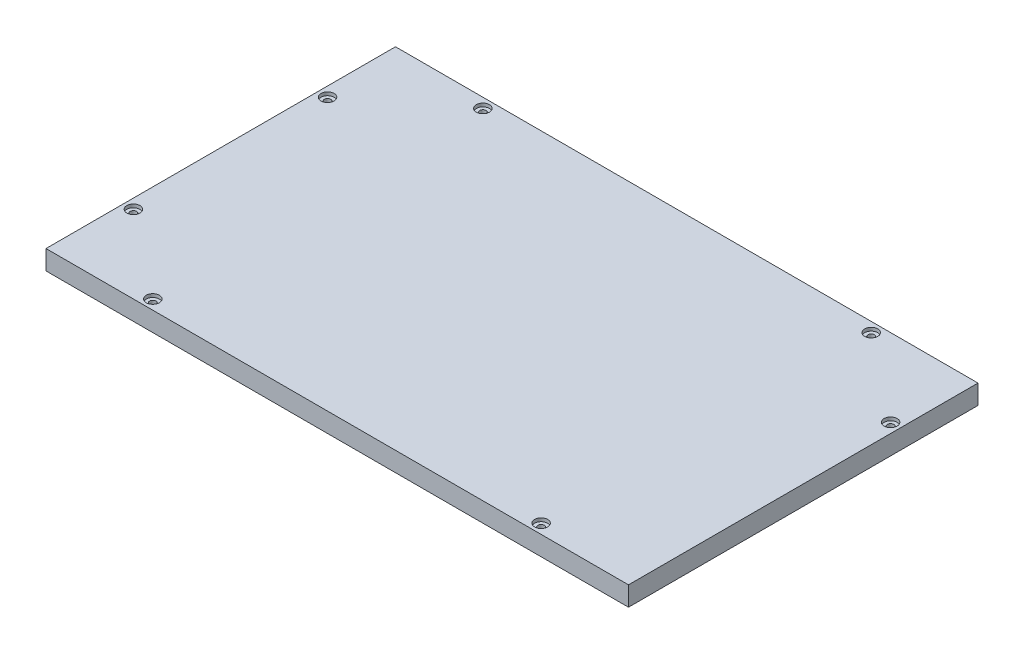
ISO-10303-21;
HEADER;
FILE_DESCRIPTION(('STEP AP214'),'2;1');
FILE_NAME('part.step','',(''),(''),'','','');
FILE_SCHEMA(('AUTOMOTIVE_DESIGN { 1 0 10303 214 1 1 1 1 }'));
ENDSEC;
DATA;
#1=APPLICATION_CONTEXT('core data for automotive mechanical design processes');
#2=APPLICATION_PROTOCOL_DEFINITION('international standard','automotive_design',2000,#1);
#3=PRODUCT_CONTEXT('',#1,'mechanical');
#4=PRODUCT('Part','Part','',(#3));
#5=PRODUCT_RELATED_PRODUCT_CATEGORY('part','',(#4));
#6=PRODUCT_DEFINITION_FORMATION('','',#4);
#7=PRODUCT_DEFINITION_CONTEXT('part definition',#1,'design');
#8=PRODUCT_DEFINITION('design','',#6,#7);
#9=PRODUCT_DEFINITION_SHAPE('','',#8);
#10=(LENGTH_UNIT() NAMED_UNIT(*) SI_UNIT(.MILLI.,.METRE.));
#11=(NAMED_UNIT(*) PLANE_ANGLE_UNIT() SI_UNIT($,.RADIAN.));
#12=(NAMED_UNIT(*) SI_UNIT($,.STERADIAN.) SOLID_ANGLE_UNIT());
#13=UNCERTAINTY_MEASURE_WITH_UNIT(LENGTH_MEASURE(1.E-05),#10,'distance_accuracy_value','');
#14=(GEOMETRIC_REPRESENTATION_CONTEXT(3) GLOBAL_UNCERTAINTY_ASSIGNED_CONTEXT((#13)) GLOBAL_UNIT_ASSIGNED_CONTEXT((#10,
#11,#12)) REPRESENTATION_CONTEXT('',''));
#15=CARTESIAN_POINT('',(0.,0.,0.));
#16=DIRECTION('',(0.,0.,1.));
#17=DIRECTION('',(1.,0.,0.));
#18=AXIS2_PLACEMENT_3D('',#15,#16,#17);
#19=CARTESIAN_POINT('',(-128.360655737705,10.,-77.7049180327869));
#20=DIRECTION('',(1.,0.,0.));
#21=DIRECTION('',(0.,0.,-1.));
#22=AXIS2_PLACEMENT_3D('',#19,#20,#21);
#23=PLANE('',#22);
#24=DIRECTION('',(0.,0.,1.));
#25=VECTOR('',#24,1.);
#26=CARTESIAN_POINT('',(-128.360655737705,0.,-77.7049180327869));
#27=LINE('',#26,#25);
#28=CARTESIAN_POINT('',(-128.360655737705,0.,-77.7049180327869));
#29=VERTEX_POINT('',#28);
#30=CARTESIAN_POINT('',(-128.360655737705,0.,102.295081967213));
#31=VERTEX_POINT('',#30);
#32=EDGE_CURVE('E107',#29,#31,#27,.T.);
#33=ORIENTED_EDGE('',*,*,#32,.T.);
#34=DIRECTION('',(0.,-1.,0.));
#35=VECTOR('',#34,1.);
#36=CARTESIAN_POINT('',(-128.360655737705,10.,102.295081967213));
#37=LINE('',#36,#35);
#38=CARTESIAN_POINT('',(-128.360655737705,10.,102.295081967213));
#39=VERTEX_POINT('',#38);
#40=EDGE_CURVE('E11',#39,#31,#37,.T.);
#41=ORIENTED_EDGE('',*,*,#40,.F.);
#42=DIRECTION('',(0.,0.,1.));
#43=VECTOR('',#42,1.);
#44=CARTESIAN_POINT('',(-128.360655737705,10.,-77.7049180327869));
#45=LINE('',#44,#43);
#46=CARTESIAN_POINT('',(-128.360655737705,10.,-77.7049180327869));
#47=VERTEX_POINT('',#46);
#48=EDGE_CURVE('E91',#47,#39,#45,.T.);
#49=ORIENTED_EDGE('',*,*,#48,.F.);
#50=DIRECTION('',(0.,-1.,0.));
#51=VECTOR('',#50,1.);
#52=CARTESIAN_POINT('',(-128.360655737705,10.,-77.7049180327869));
#53=LINE('',#52,#51);
#54=EDGE_CURVE('E103',#47,#29,#53,.T.);
#55=ORIENTED_EDGE('',*,*,#54,.T.);
#56=EDGE_LOOP('',(#33,#41,#49,#55));
#57=FACE_BOUND('',#56,.T.);
#58=ADVANCED_FACE('F39',(#57),#23,.F.);
#59=CARTESIAN_POINT('',(-128.360655737705,10.,102.295081967213));
#60=DIRECTION('',(0.,0.,-1.));
#61=DIRECTION('',(-1.,0.,0.));
#62=AXIS2_PLACEMENT_3D('',#59,#60,#61);
#63=PLANE('',#62);
#64=DIRECTION('',(1.,0.,0.));
#65=VECTOR('',#64,1.);
#66=CARTESIAN_POINT('',(-128.360655737705,0.,102.295081967213));
#67=LINE('',#66,#65);
#68=CARTESIAN_POINT('',(171.639344262295,0.,102.295081967213));
#69=VERTEX_POINT('',#68);
#70=EDGE_CURVE('E96',#31,#69,#67,.T.);
#71=ORIENTED_EDGE('',*,*,#70,.T.);
#72=DIRECTION('',(0.,-1.,0.));
#73=VECTOR('',#72,1.);
#74=CARTESIAN_POINT('',(171.639344262295,10.,102.295081967213));
#75=LINE('',#74,#73);
#76=CARTESIAN_POINT('',(171.639344262295,10.,102.295081967213));
#77=VERTEX_POINT('',#76);
#78=EDGE_CURVE('E48',#77,#69,#75,.T.);
#79=ORIENTED_EDGE('',*,*,#78,.F.);
#80=DIRECTION('',(1.,0.,0.));
#81=VECTOR('',#80,1.);
#82=CARTESIAN_POINT('',(-128.360655737705,10.,102.295081967213));
#83=LINE('',#82,#81);
#84=EDGE_CURVE('E86',#39,#77,#83,.T.);
#85=ORIENTED_EDGE('',*,*,#84,.F.);
#86=ORIENTED_EDGE('',*,*,#40,.T.);
#87=EDGE_LOOP('',(#71,#79,#85,#86));
#88=FACE_BOUND('',#87,.T.);
#89=ADVANCED_FACE('F95',(#88),#63,.F.);
#90=CARTESIAN_POINT('',(171.639344262295,10.,-77.7049180327869));
#91=DIRECTION('',(-1.,0.,0.));
#92=DIRECTION('',(0.,0.,1.));
#93=AXIS2_PLACEMENT_3D('',#90,#91,#92);
#94=PLANE('',#93);
#95=DIRECTION('',(0.,0.,-1.));
#96=VECTOR('',#95,1.);
#97=CARTESIAN_POINT('',(171.639344262295,0.,-77.7049180327869));
#98=LINE('',#97,#96);
#99=CARTESIAN_POINT('',(171.639344262295,0.,-77.7049180327869));
#100=VERTEX_POINT('',#99);
#101=EDGE_CURVE('E73',#69,#100,#98,.T.);
#102=ORIENTED_EDGE('',*,*,#101,.T.);
#103=DIRECTION('',(0.,-1.,0.));
#104=VECTOR('',#103,1.);
#105=CARTESIAN_POINT('',(171.639344262295,10.,-77.7049180327869));
#106=LINE('',#105,#104);
#107=CARTESIAN_POINT('',(171.639344262295,10.,-77.7049180327869));
#108=VERTEX_POINT('',#107);
#109=EDGE_CURVE('E98',#108,#100,#106,.T.);
#110=ORIENTED_EDGE('',*,*,#109,.F.);
#111=DIRECTION('',(0.,0.,-1.));
#112=VECTOR('',#111,1.);
#113=CARTESIAN_POINT('',(171.639344262295,10.,-77.7049180327869));
#114=LINE('',#113,#112);
#115=EDGE_CURVE('E89',#77,#108,#114,.T.);
#116=ORIENTED_EDGE('',*,*,#115,.F.);
#117=ORIENTED_EDGE('',*,*,#78,.T.);
#118=EDGE_LOOP('',(#102,#110,#116,#117));
#119=FACE_BOUND('',#118,.T.);
#120=ADVANCED_FACE('F99',(#119),#94,.F.);
#121=CARTESIAN_POINT('',(-128.360655737705,10.,-77.7049180327869));
#122=DIRECTION('',(0.,0.,1.));
#123=DIRECTION('',(1.,0.,0.));
#124=AXIS2_PLACEMENT_3D('',#121,#122,#123);
#125=PLANE('',#124);
#126=DIRECTION('',(-1.,0.,0.));
#127=VECTOR('',#126,1.);
#128=CARTESIAN_POINT('',(-128.360655737705,0.,-77.7049180327869));
#129=LINE('',#128,#127);
#130=EDGE_CURVE('E79',#100,#29,#129,.T.);
#131=ORIENTED_EDGE('',*,*,#130,.T.);
#132=ORIENTED_EDGE('',*,*,#54,.F.);
#133=DIRECTION('',(-1.,0.,0.));
#134=VECTOR('',#133,1.);
#135=CARTESIAN_POINT('',(-128.360655737705,10.,-77.7049180327869));
#136=LINE('',#135,#134);
#137=EDGE_CURVE('E56',#108,#47,#136,.T.);
#138=ORIENTED_EDGE('',*,*,#137,.F.);
#139=ORIENTED_EDGE('',*,*,#109,.T.);
#140=EDGE_LOOP('',(#131,#132,#138,#139));
#141=FACE_BOUND('',#140,.T.);
#142=ADVANCED_FACE('F121',(#141),#125,.F.);
#143=CARTESIAN_POINT('',(0.,10.,0.));
#144=DIRECTION('',(0.,1.,0.));
#145=DIRECTION('',(0.,0.,1.));
#146=AXIS2_PLACEMENT_3D('',#143,#144,#145);
#147=PLANE('',#146);
#148=CARTESIAN_POINT('',(-123.360655737705,10.,-37.7049180327869));
#149=DIRECTION('',(0.,1.,0.));
#150=DIRECTION('',(0.,0.,1.));
#151=AXIS2_PLACEMENT_3D('',#148,#149,#150);
#152=CIRCLE('',#151,3.37311999999999);
#153=CARTESIAN_POINT('',(-123.360655737705,10.,-34.3317980327869));
#154=VERTEX_POINT('',#153);
#155=EDGE_CURVE('E235',#154,#154,#152,.T.);
#156=ORIENTED_EDGE('',*,*,#155,.F.);
#157=EDGE_LOOP('',(#156));
#158=FACE_BOUND('',#157,.T.);
#159=CARTESIAN_POINT('',(-123.360655737705,10.,62.2950819672131));
#160=DIRECTION('',(0.,1.,0.));
#161=DIRECTION('',(0.,0.,1.));
#162=AXIS2_PLACEMENT_3D('',#159,#160,#161);
#163=CIRCLE('',#162,3.37311999999999);
#164=CARTESIAN_POINT('',(-123.360655737705,10.,65.6682019672131));
#165=VERTEX_POINT('',#164);
#166=EDGE_CURVE('E219',#165,#165,#163,.T.);
#167=ORIENTED_EDGE('',*,*,#166,.F.);
#168=EDGE_LOOP('',(#167));
#169=FACE_BOUND('',#168,.T.);
#170=CARTESIAN_POINT('',(-78.360655737705,10.,97.2950819672131));
#171=DIRECTION('',(0.,1.,0.));
#172=DIRECTION('',(0.,0.,1.));
#173=AXIS2_PLACEMENT_3D('',#170,#171,#172);
#174=CIRCLE('',#173,3.37311999999999);
#175=CARTESIAN_POINT('',(-78.360655737705,10.,100.668201967213));
#176=VERTEX_POINT('',#175);
#177=EDGE_CURVE('E203',#176,#176,#174,.T.);
#178=ORIENTED_EDGE('',*,*,#177,.F.);
#179=EDGE_LOOP('',(#178));
#180=FACE_BOUND('',#179,.T.);
#181=CARTESIAN_POINT('',(121.639344262295,10.,97.2950819672131));
#182=DIRECTION('',(0.,1.,0.));
#183=DIRECTION('',(0.,0.,1.));
#184=AXIS2_PLACEMENT_3D('',#181,#182,#183);
#185=CIRCLE('',#184,3.37312000000001);
#186=CARTESIAN_POINT('',(121.639344262295,10.,100.668201967213));
#187=VERTEX_POINT('',#186);
#188=EDGE_CURVE('E187',#187,#187,#185,.T.);
#189=ORIENTED_EDGE('',*,*,#188,.F.);
#190=EDGE_LOOP('',(#189));
#191=FACE_BOUND('',#190,.T.);
#192=CARTESIAN_POINT('',(121.639344262295,10.,-72.7049180327869));
#193=DIRECTION('',(0.,1.,0.));
#194=DIRECTION('',(0.,0.,1.));
#195=AXIS2_PLACEMENT_3D('',#192,#193,#194);
#196=CIRCLE('',#195,3.37312000000001);
#197=CARTESIAN_POINT('',(121.639344262295,10.,-69.3317980327869));
#198=VERTEX_POINT('',#197);
#199=EDGE_CURVE('E171',#198,#198,#196,.T.);
#200=ORIENTED_EDGE('',*,*,#199,.F.);
#201=EDGE_LOOP('',(#200));
#202=FACE_BOUND('',#201,.T.);
#203=CARTESIAN_POINT('',(166.639344262295,10.,-37.7049180327869));
#204=DIRECTION('',(0.,1.,0.));
#205=DIRECTION('',(0.,0.,1.));
#206=AXIS2_PLACEMENT_3D('',#203,#204,#205);
#207=CIRCLE('',#206,3.37312000000001);
#208=CARTESIAN_POINT('',(166.639344262295,10.,-34.3317980327869));
#209=VERTEX_POINT('',#208);
#210=EDGE_CURVE('E155',#209,#209,#207,.T.);
#211=ORIENTED_EDGE('',*,*,#210,.F.);
#212=EDGE_LOOP('',(#211));
#213=FACE_BOUND('',#212,.T.);
#214=CARTESIAN_POINT('',(-78.360655737705,10.,-72.7049180327869));
#215=DIRECTION('',(0.,1.,0.));
#216=DIRECTION('',(0.,0.,1.));
#217=AXIS2_PLACEMENT_3D('',#214,#215,#216);
#218=CIRCLE('',#217,3.37311999999999);
#219=CARTESIAN_POINT('',(-78.360655737705,10.,-69.3317980327869));
#220=VERTEX_POINT('',#219);
#221=EDGE_CURVE('E139',#220,#220,#218,.T.);
#222=ORIENTED_EDGE('',*,*,#221,.F.);
#223=EDGE_LOOP('',(#222));
#224=FACE_BOUND('',#223,.T.);
#225=ORIENTED_EDGE('',*,*,#48,.T.);
#226=ORIENTED_EDGE('',*,*,#84,.T.);
#227=ORIENTED_EDGE('',*,*,#115,.T.);
#228=ORIENTED_EDGE('',*,*,#137,.T.);
#229=EDGE_LOOP('',(#225,#226,#227,#228));
#230=FACE_BOUND('',#229,.T.);
#231=ADVANCED_FACE('F87',(#158,#169,#180,#191,#202,#213,#224,#230),#147,.T.);
#232=CARTESIAN_POINT('',(0.,0.,0.));
#233=DIRECTION('',(0.,1.,0.));
#234=DIRECTION('',(0.,0.,1.));
#235=AXIS2_PLACEMENT_3D('',#232,#233,#234);
#236=PLANE('',#235);
#237=CARTESIAN_POINT('',(-123.360655737705,0.,-37.7049180327869));
#238=DIRECTION('',(0.,1.,0.));
#239=DIRECTION('',(0.,0.,1.));
#240=AXIS2_PLACEMENT_3D('',#237,#238,#239);
#241=CIRCLE('',#240,1.63194999999999);
#242=CARTESIAN_POINT('',(-123.360655737705,0.,-36.0729680327869));
#243=VERTEX_POINT('',#242);
#244=EDGE_CURVE('E223',#243,#243,#241,.T.);
#245=ORIENTED_EDGE('',*,*,#244,.T.);
#246=EDGE_LOOP('',(#245));
#247=FACE_BOUND('',#246,.T.);
#248=CARTESIAN_POINT('',(-123.360655737705,0.,62.2950819672131));
#249=DIRECTION('',(0.,1.,0.));
#250=DIRECTION('',(0.,0.,1.));
#251=AXIS2_PLACEMENT_3D('',#248,#249,#250);
#252=CIRCLE('',#251,1.63194999999999);
#253=CARTESIAN_POINT('',(-123.360655737705,0.,63.9270319672131));
#254=VERTEX_POINT('',#253);
#255=EDGE_CURVE('E207',#254,#254,#252,.T.);
#256=ORIENTED_EDGE('',*,*,#255,.T.);
#257=EDGE_LOOP('',(#256));
#258=FACE_BOUND('',#257,.T.);
#259=CARTESIAN_POINT('',(-78.360655737705,0.,97.2950819672131));
#260=DIRECTION('',(0.,1.,0.));
#261=DIRECTION('',(0.,0.,1.));
#262=AXIS2_PLACEMENT_3D('',#259,#260,#261);
#263=CIRCLE('',#262,1.63194999999999);
#264=CARTESIAN_POINT('',(-78.360655737705,0.,98.9270319672131));
#265=VERTEX_POINT('',#264);
#266=EDGE_CURVE('E191',#265,#265,#263,.T.);
#267=ORIENTED_EDGE('',*,*,#266,.T.);
#268=EDGE_LOOP('',(#267));
#269=FACE_BOUND('',#268,.T.);
#270=CARTESIAN_POINT('',(121.639344262295,0.,97.2950819672131));
#271=DIRECTION('',(0.,1.,0.));
#272=DIRECTION('',(0.,0.,1.));
#273=AXIS2_PLACEMENT_3D('',#270,#271,#272);
#274=CIRCLE('',#273,1.63194999999999);
#275=CARTESIAN_POINT('',(121.639344262295,0.,98.9270319672131));
#276=VERTEX_POINT('',#275);
#277=EDGE_CURVE('E175',#276,#276,#274,.T.);
#278=ORIENTED_EDGE('',*,*,#277,.T.);
#279=EDGE_LOOP('',(#278));
#280=FACE_BOUND('',#279,.T.);
#281=CARTESIAN_POINT('',(121.639344262295,0.,-72.7049180327869));
#282=DIRECTION('',(0.,1.,0.));
#283=DIRECTION('',(0.,0.,1.));
#284=AXIS2_PLACEMENT_3D('',#281,#282,#283);
#285=CIRCLE('',#284,1.63194999999999);
#286=CARTESIAN_POINT('',(121.639344262295,0.,-71.0729680327869));
#287=VERTEX_POINT('',#286);
#288=EDGE_CURVE('E159',#287,#287,#285,.T.);
#289=ORIENTED_EDGE('',*,*,#288,.T.);
#290=EDGE_LOOP('',(#289));
#291=FACE_BOUND('',#290,.T.);
#292=CARTESIAN_POINT('',(166.639344262295,0.,-37.7049180327869));
#293=DIRECTION('',(0.,1.,0.));
#294=DIRECTION('',(0.,0.,1.));
#295=AXIS2_PLACEMENT_3D('',#292,#293,#294);
#296=CIRCLE('',#295,1.63194999999999);
#297=CARTESIAN_POINT('',(166.639344262295,0.,-36.0729680327869));
#298=VERTEX_POINT('',#297);
#299=EDGE_CURVE('E143',#298,#298,#296,.T.);
#300=ORIENTED_EDGE('',*,*,#299,.T.);
#301=EDGE_LOOP('',(#300));
#302=FACE_BOUND('',#301,.T.);
#303=CARTESIAN_POINT('',(-78.360655737705,0.,-72.7049180327869));
#304=DIRECTION('',(0.,1.,0.));
#305=DIRECTION('',(0.,0.,1.));
#306=AXIS2_PLACEMENT_3D('',#303,#304,#305);
#307=CIRCLE('',#306,1.63194999999999);
#308=CARTESIAN_POINT('',(-78.360655737705,0.,-71.0729680327869));
#309=VERTEX_POINT('',#308);
#310=EDGE_CURVE('E111',#309,#309,#307,.T.);
#311=ORIENTED_EDGE('',*,*,#310,.T.);
#312=EDGE_LOOP('',(#311));
#313=FACE_BOUND('',#312,.T.);
#314=ORIENTED_EDGE('',*,*,#32,.F.);
#315=ORIENTED_EDGE('',*,*,#130,.F.);
#316=ORIENTED_EDGE('',*,*,#101,.F.);
#317=ORIENTED_EDGE('',*,*,#70,.F.);
#318=EDGE_LOOP('',(#314,#315,#316,#317));
#319=FACE_BOUND('',#318,.T.);
#320=ADVANCED_FACE('F124',(#247,#258,#269,#280,#291,#302,#313,#319),#236,.F.);
#321=CARTESIAN_POINT('',(-78.360655737705,10.,-72.7049180327869));
#322=DIRECTION('',(0.,1.,0.));
#323=DIRECTION('',(0.,0.,1.));
#324=AXIS2_PLACEMENT_3D('',#321,#322,#323);
#325=CYLINDRICAL_SURFACE('',#324,1.63194999999999);
#326=ORIENTED_EDGE('',*,*,#310,.F.);
#327=EDGE_LOOP('',(#326));
#328=FACE_BOUND('',#327,.T.);
#329=CARTESIAN_POINT('',(-78.360655737705,8.2728,-72.7049180327869));
#330=DIRECTION('',(0.,1.,0.));
#331=DIRECTION('',(0.,0.,1.));
#332=AXIS2_PLACEMENT_3D('',#329,#330,#331);
#333=CIRCLE('',#332,1.63194999999999);
#334=CARTESIAN_POINT('',(-78.360655737705,8.2728,-71.0729680327869));
#335=VERTEX_POINT('',#334);
#336=EDGE_CURVE('E131',#335,#335,#333,.T.);
#337=ORIENTED_EDGE('',*,*,#336,.T.);
#338=EDGE_LOOP('',(#337));
#339=FACE_BOUND('',#338,.T.);
#340=ADVANCED_FACE('F270',(#328,#339),#325,.F.);
#341=CARTESIAN_POINT('',(-76.728705737705,8.2728,-72.7049180327869));
#342=DIRECTION('',(0.,-1.,0.));
#343=DIRECTION('',(0.,0.,-1.));
#344=AXIS2_PLACEMENT_3D('',#341,#342,#343);
#345=PLANE('',#344);
#346=ORIENTED_EDGE('',*,*,#336,.F.);
#347=EDGE_LOOP('',(#346));
#348=FACE_BOUND('',#347,.T.);
#349=CARTESIAN_POINT('',(-78.360655737705,8.2728,-72.7049180327869));
#350=DIRECTION('',(0.,1.,0.));
#351=DIRECTION('',(0.,0.,1.));
#352=AXIS2_PLACEMENT_3D('',#349,#350,#351);
#353=CIRCLE('',#352,3.37311999999999);
#354=CARTESIAN_POINT('',(-78.360655737705,8.2728,-69.3317980327869));
#355=VERTEX_POINT('',#354);
#356=EDGE_CURVE('E135',#355,#355,#353,.T.);
#357=ORIENTED_EDGE('',*,*,#356,.T.);
#358=EDGE_LOOP('',(#357));
#359=FACE_BOUND('',#358,.T.);
#360=ADVANCED_FACE('F260',(#348,#359),#345,.F.);
#361=CARTESIAN_POINT('',(-78.360655737705,10.,-72.7049180327869));
#362=DIRECTION('',(0.,1.,0.));
#363=DIRECTION('',(0.,0.,1.));
#364=AXIS2_PLACEMENT_3D('',#361,#362,#363);
#365=CYLINDRICAL_SURFACE('',#364,3.37311999999999);
#366=ORIENTED_EDGE('',*,*,#356,.F.);
#367=EDGE_LOOP('',(#366));
#368=FACE_BOUND('',#367,.T.);
#369=ORIENTED_EDGE('',*,*,#221,.T.);
#370=EDGE_LOOP('',(#369));
#371=FACE_BOUND('',#370,.T.);
#372=ADVANCED_FACE('F257',(#368,#371),#365,.F.);
#373=CARTESIAN_POINT('',(166.639344262295,10.,-37.7049180327869));
#374=DIRECTION('',(0.,1.,0.));
#375=DIRECTION('',(0.,0.,1.));
#376=AXIS2_PLACEMENT_3D('',#373,#374,#375);
#377=CYLINDRICAL_SURFACE('',#376,1.63194999999999);
#378=ORIENTED_EDGE('',*,*,#299,.F.);
#379=EDGE_LOOP('',(#378));
#380=FACE_BOUND('',#379,.T.);
#381=CARTESIAN_POINT('',(166.639344262295,8.2728,-37.7049180327869));
#382=DIRECTION('',(0.,1.,0.));
#383=DIRECTION('',(0.,0.,1.));
#384=AXIS2_PLACEMENT_3D('',#381,#382,#383);
#385=CIRCLE('',#384,1.63194999999999);
#386=CARTESIAN_POINT('',(166.639344262295,8.2728,-36.0729680327869));
#387=VERTEX_POINT('',#386);
#388=EDGE_CURVE('E147',#387,#387,#385,.T.);
#389=ORIENTED_EDGE('',*,*,#388,.T.);
#390=EDGE_LOOP('',(#389));
#391=FACE_BOUND('',#390,.T.);
#392=ADVANCED_FACE('F259',(#380,#391),#377,.F.);
#393=CARTESIAN_POINT('',(168.271294262295,8.2728,-37.7049180327869));
#394=DIRECTION('',(0.,-1.,0.));
#395=DIRECTION('',(0.,0.,-1.));
#396=AXIS2_PLACEMENT_3D('',#393,#394,#395);
#397=PLANE('',#396);
#398=ORIENTED_EDGE('',*,*,#388,.F.);
#399=EDGE_LOOP('',(#398));
#400=FACE_BOUND('',#399,.T.);
#401=CARTESIAN_POINT('',(166.639344262295,8.2728,-37.7049180327869));
#402=DIRECTION('',(0.,1.,0.));
#403=DIRECTION('',(0.,0.,1.));
#404=AXIS2_PLACEMENT_3D('',#401,#402,#403);
#405=CIRCLE('',#404,3.37312000000001);
#406=CARTESIAN_POINT('',(166.639344262295,8.2728,-34.3317980327869));
#407=VERTEX_POINT('',#406);
#408=EDGE_CURVE('E151',#407,#407,#405,.T.);
#409=ORIENTED_EDGE('',*,*,#408,.T.);
#410=EDGE_LOOP('',(#409));
#411=FACE_BOUND('',#410,.T.);
#412=ADVANCED_FACE('F267',(#400,#411),#397,.F.);
#413=CARTESIAN_POINT('',(166.639344262295,10.,-37.7049180327869));
#414=DIRECTION('',(0.,1.,0.));
#415=DIRECTION('',(0.,0.,1.));
#416=AXIS2_PLACEMENT_3D('',#413,#414,#415);
#417=CYLINDRICAL_SURFACE('',#416,3.37312000000001);
#418=ORIENTED_EDGE('',*,*,#408,.F.);
#419=EDGE_LOOP('',(#418));
#420=FACE_BOUND('',#419,.T.);
#421=ORIENTED_EDGE('',*,*,#210,.T.);
#422=EDGE_LOOP('',(#421));
#423=FACE_BOUND('',#422,.T.);
#424=ADVANCED_FACE('F322',(#420,#423),#417,.F.);
#425=CARTESIAN_POINT('',(121.639344262295,10.,-72.7049180327869));
#426=DIRECTION('',(0.,1.,0.));
#427=DIRECTION('',(0.,0.,1.));
#428=AXIS2_PLACEMENT_3D('',#425,#426,#427);
#429=CYLINDRICAL_SURFACE('',#428,1.63194999999999);
#430=ORIENTED_EDGE('',*,*,#288,.F.);
#431=EDGE_LOOP('',(#430));
#432=FACE_BOUND('',#431,.T.);
#433=CARTESIAN_POINT('',(121.639344262295,8.2728,-72.7049180327869));
#434=DIRECTION('',(0.,1.,0.));
#435=DIRECTION('',(0.,0.,1.));
#436=AXIS2_PLACEMENT_3D('',#433,#434,#435);
#437=CIRCLE('',#436,1.63194999999999);
#438=CARTESIAN_POINT('',(121.639344262295,8.2728,-71.0729680327869));
#439=VERTEX_POINT('',#438);
#440=EDGE_CURVE('E163',#439,#439,#437,.T.);
#441=ORIENTED_EDGE('',*,*,#440,.T.);
#442=EDGE_LOOP('',(#441));
#443=FACE_BOUND('',#442,.T.);
#444=ADVANCED_FACE('F332',(#432,#443),#429,.F.);
#445=CARTESIAN_POINT('',(123.271294262295,8.2728,-72.7049180327869));
#446=DIRECTION('',(0.,-1.,0.));
#447=DIRECTION('',(0.,0.,-1.));
#448=AXIS2_PLACEMENT_3D('',#445,#446,#447);
#449=PLANE('',#448);
#450=ORIENTED_EDGE('',*,*,#440,.F.);
#451=EDGE_LOOP('',(#450));
#452=FACE_BOUND('',#451,.T.);
#453=CARTESIAN_POINT('',(121.639344262295,8.2728,-72.7049180327869));
#454=DIRECTION('',(0.,1.,0.));
#455=DIRECTION('',(0.,0.,1.));
#456=AXIS2_PLACEMENT_3D('',#453,#454,#455);
#457=CIRCLE('',#456,3.37312000000001);
#458=CARTESIAN_POINT('',(121.639344262295,8.2728,-69.3317980327869));
#459=VERTEX_POINT('',#458);
#460=EDGE_CURVE('E167',#459,#459,#457,.T.);
#461=ORIENTED_EDGE('',*,*,#460,.T.);
#462=EDGE_LOOP('',(#461));
#463=FACE_BOUND('',#462,.T.);
#464=ADVANCED_FACE('F342',(#452,#463),#449,.F.);
#465=CARTESIAN_POINT('',(121.639344262295,10.,-72.7049180327869));
#466=DIRECTION('',(0.,1.,0.));
#467=DIRECTION('',(0.,0.,1.));
#468=AXIS2_PLACEMENT_3D('',#465,#466,#467);
#469=CYLINDRICAL_SURFACE('',#468,3.37312000000001);
#470=ORIENTED_EDGE('',*,*,#460,.F.);
#471=EDGE_LOOP('',(#470));
#472=FACE_BOUND('',#471,.T.);
#473=ORIENTED_EDGE('',*,*,#199,.T.);
#474=EDGE_LOOP('',(#473));
#475=FACE_BOUND('',#474,.T.);
#476=ADVANCED_FACE('F352',(#472,#475),#469,.F.);
#477=CARTESIAN_POINT('',(121.639344262295,10.,97.2950819672131));
#478=DIRECTION('',(0.,1.,0.));
#479=DIRECTION('',(0.,0.,1.));
#480=AXIS2_PLACEMENT_3D('',#477,#478,#479);
#481=CYLINDRICAL_SURFACE('',#480,1.63194999999999);
#482=ORIENTED_EDGE('',*,*,#277,.F.);
#483=EDGE_LOOP('',(#482));
#484=FACE_BOUND('',#483,.T.);
#485=CARTESIAN_POINT('',(121.639344262295,8.2728,97.2950819672131));
#486=DIRECTION('',(0.,1.,0.));
#487=DIRECTION('',(0.,0.,1.));
#488=AXIS2_PLACEMENT_3D('',#485,#486,#487);
#489=CIRCLE('',#488,1.63194999999999);
#490=CARTESIAN_POINT('',(121.639344262295,8.2728,98.9270319672131));
#491=VERTEX_POINT('',#490);
#492=EDGE_CURVE('E179',#491,#491,#489,.T.);
#493=ORIENTED_EDGE('',*,*,#492,.T.);
#494=EDGE_LOOP('',(#493));
#495=FACE_BOUND('',#494,.T.);
#496=ADVANCED_FACE('F362',(#484,#495),#481,.F.);
#497=CARTESIAN_POINT('',(123.271294262295,8.2728,97.2950819672131));
#498=DIRECTION('',(0.,-1.,0.));
#499=DIRECTION('',(0.,0.,-1.));
#500=AXIS2_PLACEMENT_3D('',#497,#498,#499);
#501=PLANE('',#500);
#502=ORIENTED_EDGE('',*,*,#492,.F.);
#503=EDGE_LOOP('',(#502));
#504=FACE_BOUND('',#503,.T.);
#505=CARTESIAN_POINT('',(121.639344262295,8.2728,97.2950819672131));
#506=DIRECTION('',(0.,1.,0.));
#507=DIRECTION('',(0.,0.,1.));
#508=AXIS2_PLACEMENT_3D('',#505,#506,#507);
#509=CIRCLE('',#508,3.37312000000001);
#510=CARTESIAN_POINT('',(121.639344262295,8.2728,100.668201967213));
#511=VERTEX_POINT('',#510);
#512=EDGE_CURVE('E183',#511,#511,#509,.T.);
#513=ORIENTED_EDGE('',*,*,#512,.T.);
#514=EDGE_LOOP('',(#513));
#515=FACE_BOUND('',#514,.T.);
#516=ADVANCED_FACE('F372',(#504,#515),#501,.F.);
#517=CARTESIAN_POINT('',(121.639344262295,10.,97.2950819672131));
#518=DIRECTION('',(0.,1.,0.));
#519=DIRECTION('',(0.,0.,1.));
#520=AXIS2_PLACEMENT_3D('',#517,#518,#519);
#521=CYLINDRICAL_SURFACE('',#520,3.37312000000001);
#522=ORIENTED_EDGE('',*,*,#512,.F.);
#523=EDGE_LOOP('',(#522));
#524=FACE_BOUND('',#523,.T.);
#525=ORIENTED_EDGE('',*,*,#188,.T.);
#526=EDGE_LOOP('',(#525));
#527=FACE_BOUND('',#526,.T.);
#528=ADVANCED_FACE('F382',(#524,#527),#521,.F.);
#529=CARTESIAN_POINT('',(-78.360655737705,10.,97.2950819672131));
#530=DIRECTION('',(0.,1.,0.));
#531=DIRECTION('',(0.,0.,1.));
#532=AXIS2_PLACEMENT_3D('',#529,#530,#531);
#533=CYLINDRICAL_SURFACE('',#532,1.63194999999999);
#534=ORIENTED_EDGE('',*,*,#266,.F.);
#535=EDGE_LOOP('',(#534));
#536=FACE_BOUND('',#535,.T.);
#537=CARTESIAN_POINT('',(-78.360655737705,8.2728,97.2950819672131));
#538=DIRECTION('',(0.,1.,0.));
#539=DIRECTION('',(0.,0.,1.));
#540=AXIS2_PLACEMENT_3D('',#537,#538,#539);
#541=CIRCLE('',#540,1.63194999999999);
#542=CARTESIAN_POINT('',(-78.360655737705,8.2728,98.9270319672131));
#543=VERTEX_POINT('',#542);
#544=EDGE_CURVE('E195',#543,#543,#541,.T.);
#545=ORIENTED_EDGE('',*,*,#544,.T.);
#546=EDGE_LOOP('',(#545));
#547=FACE_BOUND('',#546,.T.);
#548=ADVANCED_FACE('F392',(#536,#547),#533,.F.);
#549=CARTESIAN_POINT('',(-76.728705737705,8.2728,97.2950819672131));
#550=DIRECTION('',(0.,-1.,0.));
#551=DIRECTION('',(0.,0.,-1.));
#552=AXIS2_PLACEMENT_3D('',#549,#550,#551);
#553=PLANE('',#552);
#554=ORIENTED_EDGE('',*,*,#544,.F.);
#555=EDGE_LOOP('',(#554));
#556=FACE_BOUND('',#555,.T.);
#557=CARTESIAN_POINT('',(-78.360655737705,8.2728,97.2950819672131));
#558=DIRECTION('',(0.,1.,0.));
#559=DIRECTION('',(0.,0.,1.));
#560=AXIS2_PLACEMENT_3D('',#557,#558,#559);
#561=CIRCLE('',#560,3.37311999999999);
#562=CARTESIAN_POINT('',(-78.360655737705,8.2728,100.668201967213));
#563=VERTEX_POINT('',#562);
#564=EDGE_CURVE('E199',#563,#563,#561,.T.);
#565=ORIENTED_EDGE('',*,*,#564,.T.);
#566=EDGE_LOOP('',(#565));
#567=FACE_BOUND('',#566,.T.);
#568=ADVANCED_FACE('F402',(#556,#567),#553,.F.);
#569=CARTESIAN_POINT('',(-78.360655737705,10.,97.2950819672131));
#570=DIRECTION('',(0.,1.,0.));
#571=DIRECTION('',(0.,0.,1.));
#572=AXIS2_PLACEMENT_3D('',#569,#570,#571);
#573=CYLINDRICAL_SURFACE('',#572,3.37311999999999);
#574=ORIENTED_EDGE('',*,*,#564,.F.);
#575=EDGE_LOOP('',(#574));
#576=FACE_BOUND('',#575,.T.);
#577=ORIENTED_EDGE('',*,*,#177,.T.);
#578=EDGE_LOOP('',(#577));
#579=FACE_BOUND('',#578,.T.);
#580=ADVANCED_FACE('F412',(#576,#579),#573,.F.);
#581=CARTESIAN_POINT('',(-123.360655737705,10.,62.2950819672131));
#582=DIRECTION('',(0.,1.,0.));
#583=DIRECTION('',(0.,0.,1.));
#584=AXIS2_PLACEMENT_3D('',#581,#582,#583);
#585=CYLINDRICAL_SURFACE('',#584,1.63194999999999);
#586=ORIENTED_EDGE('',*,*,#255,.F.);
#587=EDGE_LOOP('',(#586));
#588=FACE_BOUND('',#587,.T.);
#589=CARTESIAN_POINT('',(-123.360655737705,8.2728,62.2950819672131));
#590=DIRECTION('',(0.,1.,0.));
#591=DIRECTION('',(0.,0.,1.));
#592=AXIS2_PLACEMENT_3D('',#589,#590,#591);
#593=CIRCLE('',#592,1.63194999999999);
#594=CARTESIAN_POINT('',(-123.360655737705,8.2728,63.9270319672131));
#595=VERTEX_POINT('',#594);
#596=EDGE_CURVE('E211',#595,#595,#593,.T.);
#597=ORIENTED_EDGE('',*,*,#596,.T.);
#598=EDGE_LOOP('',(#597));
#599=FACE_BOUND('',#598,.T.);
#600=ADVANCED_FACE('F422',(#588,#599),#585,.F.);
#601=CARTESIAN_POINT('',(-121.728705737705,8.2728,62.2950819672131));
#602=DIRECTION('',(0.,-1.,0.));
#603=DIRECTION('',(0.,0.,-1.));
#604=AXIS2_PLACEMENT_3D('',#601,#602,#603);
#605=PLANE('',#604);
#606=ORIENTED_EDGE('',*,*,#596,.F.);
#607=EDGE_LOOP('',(#606));
#608=FACE_BOUND('',#607,.T.);
#609=CARTESIAN_POINT('',(-123.360655737705,8.2728,62.2950819672131));
#610=DIRECTION('',(0.,1.,0.));
#611=DIRECTION('',(0.,0.,1.));
#612=AXIS2_PLACEMENT_3D('',#609,#610,#611);
#613=CIRCLE('',#612,3.37311999999999);
#614=CARTESIAN_POINT('',(-123.360655737705,8.2728,65.6682019672131));
#615=VERTEX_POINT('',#614);
#616=EDGE_CURVE('E215',#615,#615,#613,.T.);
#617=ORIENTED_EDGE('',*,*,#616,.T.);
#618=EDGE_LOOP('',(#617));
#619=FACE_BOUND('',#618,.T.);
#620=ADVANCED_FACE('F432',(#608,#619),#605,.F.);
#621=CARTESIAN_POINT('',(-123.360655737705,10.,62.2950819672131));
#622=DIRECTION('',(0.,1.,0.));
#623=DIRECTION('',(0.,0.,1.));
#624=AXIS2_PLACEMENT_3D('',#621,#622,#623);
#625=CYLINDRICAL_SURFACE('',#624,3.37311999999999);
#626=ORIENTED_EDGE('',*,*,#616,.F.);
#627=EDGE_LOOP('',(#626));
#628=FACE_BOUND('',#627,.T.);
#629=ORIENTED_EDGE('',*,*,#166,.T.);
#630=EDGE_LOOP('',(#629));
#631=FACE_BOUND('',#630,.T.);
#632=ADVANCED_FACE('F442',(#628,#631),#625,.F.);
#633=CARTESIAN_POINT('',(-123.360655737705,10.,-37.7049180327869));
#634=DIRECTION('',(0.,1.,0.));
#635=DIRECTION('',(0.,0.,1.));
#636=AXIS2_PLACEMENT_3D('',#633,#634,#635);
#637=CYLINDRICAL_SURFACE('',#636,1.63194999999999);
#638=ORIENTED_EDGE('',*,*,#244,.F.);
#639=EDGE_LOOP('',(#638));
#640=FACE_BOUND('',#639,.T.);
#641=CARTESIAN_POINT('',(-123.360655737705,8.2728,-37.7049180327869));
#642=DIRECTION('',(0.,1.,0.));
#643=DIRECTION('',(0.,0.,1.));
#644=AXIS2_PLACEMENT_3D('',#641,#642,#643);
#645=CIRCLE('',#644,1.63194999999999);
#646=CARTESIAN_POINT('',(-123.360655737705,8.2728,-36.0729680327869));
#647=VERTEX_POINT('',#646);
#648=EDGE_CURVE('E227',#647,#647,#645,.T.);
#649=ORIENTED_EDGE('',*,*,#648,.T.);
#650=EDGE_LOOP('',(#649));
#651=FACE_BOUND('',#650,.T.);
#652=ADVANCED_FACE('F452',(#640,#651),#637,.F.);
#653=CARTESIAN_POINT('',(-121.728705737705,8.2728,-37.7049180327869));
#654=DIRECTION('',(0.,-1.,0.));
#655=DIRECTION('',(0.,0.,-1.));
#656=AXIS2_PLACEMENT_3D('',#653,#654,#655);
#657=PLANE('',#656);
#658=ORIENTED_EDGE('',*,*,#648,.F.);
#659=EDGE_LOOP('',(#658));
#660=FACE_BOUND('',#659,.T.);
#661=CARTESIAN_POINT('',(-123.360655737705,8.2728,-37.7049180327869));
#662=DIRECTION('',(0.,1.,0.));
#663=DIRECTION('',(0.,0.,1.));
#664=AXIS2_PLACEMENT_3D('',#661,#662,#663);
#665=CIRCLE('',#664,3.37311999999999);
#666=CARTESIAN_POINT('',(-123.360655737705,8.2728,-34.3317980327869));
#667=VERTEX_POINT('',#666);
#668=EDGE_CURVE('E231',#667,#667,#665,.T.);
#669=ORIENTED_EDGE('',*,*,#668,.T.);
#670=EDGE_LOOP('',(#669));
#671=FACE_BOUND('',#670,.T.);
#672=ADVANCED_FACE('F462',(#660,#671),#657,.F.);
#673=CARTESIAN_POINT('',(-123.360655737705,10.,-37.7049180327869));
#674=DIRECTION('',(0.,1.,0.));
#675=DIRECTION('',(0.,0.,1.));
#676=AXIS2_PLACEMENT_3D('',#673,#674,#675);
#677=CYLINDRICAL_SURFACE('',#676,3.37311999999999);
#678=ORIENTED_EDGE('',*,*,#668,.F.);
#679=EDGE_LOOP('',(#678));
#680=FACE_BOUND('',#679,.T.);
#681=ORIENTED_EDGE('',*,*,#155,.T.);
#682=EDGE_LOOP('',(#681));
#683=FACE_BOUND('',#682,.T.);
#684=ADVANCED_FACE('F240',(#680,#683),#677,.F.);
#685=CLOSED_SHELL('',(#58,#89,#120,#142,#231,#320,#340,#360,#372,#392,#412,#424,#444,#464,#476,
#496,#516,#528,#548,#568,#580,#600,#620,#632,#652,#672,#684));
#686=MANIFOLD_SOLID_BREP('B2',#685);
#687=ADVANCED_BREP_SHAPE_REPRESENTATION('',(#18,#686),#14);
#688=SHAPE_DEFINITION_REPRESENTATION(#9,#687);
ENDSEC;
END-ISO-10303-21;
